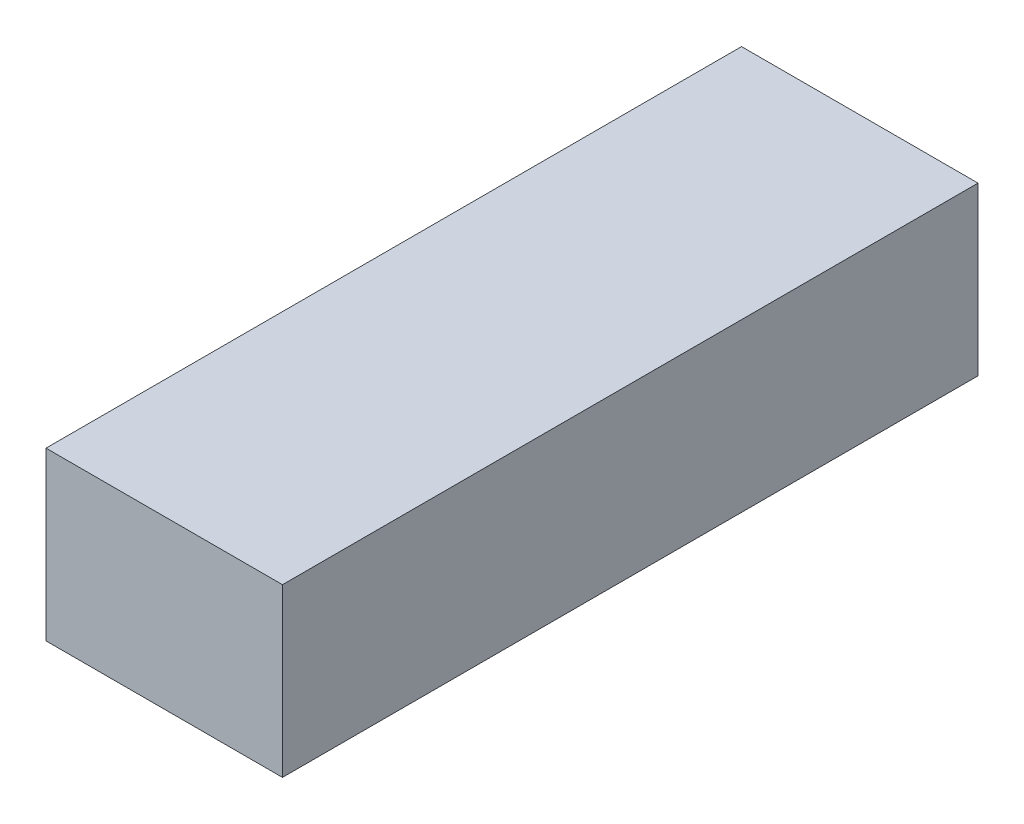
ISO-10303-21;
HEADER;
FILE_DESCRIPTION(('STEP AP214'),'2;1');
FILE_NAME('part.step','',(''),(''),'','','');
FILE_SCHEMA(('AUTOMOTIVE_DESIGN { 1 0 10303 214 1 1 1 1 }'));
ENDSEC;
DATA;
#1=APPLICATION_CONTEXT('core data for automotive mechanical design processes');
#2=APPLICATION_PROTOCOL_DEFINITION('international standard','automotive_design',2000,#1);
#3=PRODUCT_CONTEXT('',#1,'mechanical');
#4=PRODUCT('Part','Part','',(#3));
#5=PRODUCT_RELATED_PRODUCT_CATEGORY('part','',(#4));
#6=PRODUCT_DEFINITION_FORMATION('','',#4);
#7=PRODUCT_DEFINITION_CONTEXT('part definition',#1,'design');
#8=PRODUCT_DEFINITION('design','',#6,#7);
#9=PRODUCT_DEFINITION_SHAPE('','',#8);
#10=(LENGTH_UNIT() NAMED_UNIT(*) SI_UNIT(.MILLI.,.METRE.));
#11=(NAMED_UNIT(*) PLANE_ANGLE_UNIT() SI_UNIT($,.RADIAN.));
#12=(NAMED_UNIT(*) SI_UNIT($,.STERADIAN.) SOLID_ANGLE_UNIT());
#13=UNCERTAINTY_MEASURE_WITH_UNIT(LENGTH_MEASURE(1.E-05),#10,'distance_accuracy_value','');
#14=(GEOMETRIC_REPRESENTATION_CONTEXT(3) GLOBAL_UNCERTAINTY_ASSIGNED_CONTEXT((#13)) GLOBAL_UNIT_ASSIGNED_CONTEXT((#10,
#11,#12)) REPRESENTATION_CONTEXT('',''));
#15=CARTESIAN_POINT('',(0.,0.,0.));
#16=DIRECTION('',(0.,0.,1.));
#17=DIRECTION('',(1.,0.,0.));
#18=AXIS2_PLACEMENT_3D('',#15,#16,#17);
#19=CARTESIAN_POINT('',(0.,2.8,0.));
#20=DIRECTION('',(0.,1.,0.));
#21=DIRECTION('',(0.,0.,1.));
#22=AXIS2_PLACEMENT_3D('',#19,#20,#21);
#23=PLANE('',#22);
#24=CARTESIAN_POINT('',(0.,2.8,-19.1127944876397));
#25=DIRECTION('',(0.,1.,0.));
#26=DIRECTION('',(0.,0.,-1.));
#27=AXIS2_PLACEMENT_3D('',#24,#25,#26);
#28=ELLIPSE('',#27,4.38973331146314,4.125);
#29=CARTESIAN_POINT('',(-3.45,2.8,-16.7064522809072));
#30=VERTEX_POINT('',#29);
#31=CARTESIAN_POINT('',(-0.299801587279874,2.8,-14.7346703882399));
#32=VERTEX_POINT('',#31);
#33=EDGE_CURVE('E253',#30,#32,#28,.T.);
#34=ORIENTED_EDGE('',*,*,#33,.F.);
#35=DIRECTION('',(0.,0.,1.));
#36=VECTOR('',#35,1.);
#37=CARTESIAN_POINT('',(-3.45,2.8,0.));
#38=LINE('',#37,#36);
#39=CARTESIAN_POINT('',(-3.45,2.8,-3.95));
#40=VERTEX_POINT('',#39);
#41=EDGE_CURVE('E299',#30,#40,#38,.T.);
#42=ORIENTED_EDGE('',*,*,#41,.T.);
#43=DIRECTION('',(-1.,0.,0.));
#44=VECTOR('',#43,1.);
#45=CARTESIAN_POINT('',(-3.95,2.8,-3.95));
#46=LINE('',#45,#44);
#47=CARTESIAN_POINT('',(3.45,2.8,-3.95));
#48=VERTEX_POINT('',#47);
#49=EDGE_CURVE('E329',#48,#40,#46,.T.);
#50=ORIENTED_EDGE('',*,*,#49,.F.);
#51=DIRECTION('',(0.,0.,1.));
#52=VECTOR('',#51,1.);
#53=CARTESIAN_POINT('',(3.45,2.8,0.));
#54=LINE('',#53,#52);
#55=CARTESIAN_POINT('',(3.45,2.8,-16.7064522809072));
#56=VERTEX_POINT('',#55);
#57=EDGE_CURVE('E306',#56,#48,#54,.T.);
#58=ORIENTED_EDGE('',*,*,#57,.F.);
#59=CARTESIAN_POINT('',(0.,2.8,-19.1127944876397));
#60=DIRECTION('',(0.,1.,0.));
#61=DIRECTION('',(0.,0.,-1.));
#62=AXIS2_PLACEMENT_3D('',#59,#60,#61);
#63=ELLIPSE('',#62,4.38973331146314,4.125);
#64=CARTESIAN_POINT('',(0.299801587279874,2.8,-14.7346703882399));
#65=VERTEX_POINT('',#64);
#66=EDGE_CURVE('E248',#65,#56,#63,.T.);
#67=ORIENTED_EDGE('',*,*,#66,.F.);
#68=CARTESIAN_POINT('',(0.,2.8,-14.7230611761765));
#69=DIRECTION('',(0.,1.,0.));
#70=DIRECTION('',(0.,0.,-1.));
#71=AXIS2_PLACEMENT_3D('',#68,#69,#70);
#72=ELLIPSE('',#71,0.319253331742773,0.3);
#73=EDGE_CURVE('E263',#65,#32,#72,.T.);
#74=ORIENTED_EDGE('',*,*,#73,.T.);
#75=EDGE_LOOP('',(#34,#42,#50,#58,#67,#74));
#76=FACE_BOUND('',#75,.T.);
#77=ADVANCED_FACE('F35',(#76),#23,.T.);
#78=CARTESIAN_POINT('',(0.,0.,0.));
#79=DIRECTION('',(0.,1.,0.));
#80=DIRECTION('',(0.,0.,1.));
#81=AXIS2_PLACEMENT_3D('',#78,#79,#80);
#82=PLANE('',#81);
#83=DIRECTION('',(1.,0.,0.));
#84=VECTOR('',#83,1.);
#85=CARTESIAN_POINT('',(3.95,0.,4.95));
#86=LINE('',#85,#84);
#87=CARTESIAN_POINT('',(-3.95,0.,4.95));
#88=VERTEX_POINT('',#87);
#89=CARTESIAN_POINT('',(3.95,0.,4.95));
#90=VERTEX_POINT('',#89);
#91=EDGE_CURVE('E390',#88,#90,#86,.T.);
#92=ORIENTED_EDGE('',*,*,#91,.T.);
#93=DIRECTION('',(0.,0.,-1.));
#94=VECTOR('',#93,1.);
#95=CARTESIAN_POINT('',(3.95,0.,-3.95));
#96=LINE('',#95,#94);
#97=CARTESIAN_POINT('',(3.95,0.,-3.95));
#98=VERTEX_POINT('',#97);
#99=EDGE_CURVE('E319',#90,#98,#96,.T.);
#100=ORIENTED_EDGE('',*,*,#99,.T.);
#101=DIRECTION('',(-1.,0.,0.));
#102=VECTOR('',#101,1.);
#103=CARTESIAN_POINT('',(-3.95,0.,-3.95));
#104=LINE('',#103,#102);
#105=CARTESIAN_POINT('',(-3.95,0.,-3.95));
#106=VERTEX_POINT('',#105);
#107=EDGE_CURVE('E338',#98,#106,#104,.T.);
#108=ORIENTED_EDGE('',*,*,#107,.T.);
#109=DIRECTION('',(0.,0.,1.));
#110=VECTOR('',#109,1.);
#111=CARTESIAN_POINT('',(-3.95,0.,-3.95));
#112=LINE('',#111,#110);
#113=EDGE_CURVE('E324',#106,#88,#112,.T.);
#114=ORIENTED_EDGE('',*,*,#113,.T.);
#115=EDGE_LOOP('',(#92,#100,#108,#114));
#116=FACE_BOUND('',#115,.T.);
#117=DIRECTION('',(0.,0.,-1.));
#118=VECTOR('',#117,1.);
#119=CARTESIAN_POINT('',(5.95,0.,-26.65));
#120=LINE('',#119,#118);
#121=CARTESIAN_POINT('',(5.95,0.,8.35));
#122=VERTEX_POINT('',#121);
#123=CARTESIAN_POINT('',(5.95,0.,-26.65));
#124=VERTEX_POINT('',#123);
#125=EDGE_CURVE('E350',#122,#124,#120,.T.);
#126=ORIENTED_EDGE('',*,*,#125,.F.);
#127=DIRECTION('',(1.,0.,0.));
#128=VECTOR('',#127,1.);
#129=CARTESIAN_POINT('',(-5.95,0.,8.35));
#130=LINE('',#129,#128);
#131=CARTESIAN_POINT('',(-5.95,0.,8.35));
#132=VERTEX_POINT('',#131);
#133=EDGE_CURVE('E357',#132,#122,#130,.T.);
#134=ORIENTED_EDGE('',*,*,#133,.F.);
#135=DIRECTION('',(0.,0.,1.));
#136=VECTOR('',#135,1.);
#137=CARTESIAN_POINT('',(-5.95,0.,-26.65));
#138=LINE('',#137,#136);
#139=CARTESIAN_POINT('',(-5.95,0.,-26.65));
#140=VERTEX_POINT('',#139);
#141=EDGE_CURVE('E355',#140,#132,#138,.T.);
#142=ORIENTED_EDGE('',*,*,#141,.F.);
#143=DIRECTION('',(-1.,0.,0.));
#144=VECTOR('',#143,1.);
#145=CARTESIAN_POINT('',(-5.95,0.,-26.65));
#146=LINE('',#145,#144);
#147=EDGE_CURVE('E353',#124,#140,#146,.T.);
#148=ORIENTED_EDGE('',*,*,#147,.F.);
#149=EDGE_LOOP('',(#126,#134,#142,#148));
#150=FACE_BOUND('',#149,.T.);
#151=CARTESIAN_POINT('',(0.,0.,-24.5216444550482));
#152=DIRECTION('',(0.,1.,0.));
#153=DIRECTION('',(0.,0.,-1.));
#154=AXIS2_PLACEMENT_3D('',#151,#152,#153);
#155=ELLIPSE('',#154,0.319253331742775,0.300000000000001);
#156=CARTESIAN_POINT('',(-0.299801587279886,0.,-24.5100352429848));
#157=VERTEX_POINT('',#156);
#158=CARTESIAN_POINT('',(0.299801587279885,0.,-24.5100352429848));
#159=VERTEX_POINT('',#158);
#160=EDGE_CURVE('E387',#157,#159,#155,.T.);
#161=ORIENTED_EDGE('',*,*,#160,.F.);
#162=CARTESIAN_POINT('',(0.,0.,-20.131911143585));
#163=DIRECTION('',(0.,1.,0.));
#164=DIRECTION('',(0.,0.,-1.));
#165=AXIS2_PLACEMENT_3D('',#162,#163,#164);
#166=ELLIPSE('',#165,4.38973331146314,4.125);
#167=CARTESIAN_POINT('',(-4.11409090909091,0.,-20.4509533289213));
#168=VERTEX_POINT('',#167);
#169=EDGE_CURVE('E260',#157,#168,#166,.T.);
#170=ORIENTED_EDGE('',*,*,#169,.T.);
#171=CARTESIAN_POINT('',(-4.125,0.,-20.131911143585));
#172=DIRECTION('',(0.,1.,0.));
#173=DIRECTION('',(0.,0.,-1.));
#174=AXIS2_PLACEMENT_3D('',#171,#172,#173);
#175=ELLIPSE('',#174,0.319253331742775,0.300000000000001);
#176=CARTESIAN_POINT('',(-4.11409090909091,0.,-19.8128689582488));
#177=VERTEX_POINT('',#176);
#178=EDGE_CURVE('E385',#177,#168,#175,.T.);
#179=ORIENTED_EDGE('',*,*,#178,.F.);
#180=CARTESIAN_POINT('',(0.,0.,-20.131911143585));
#181=DIRECTION('',(0.,1.,0.));
#182=DIRECTION('',(0.,0.,-1.));
#183=AXIS2_PLACEMENT_3D('',#180,#181,#182);
#184=ELLIPSE('',#183,4.38973331146314,4.125);
#185=CARTESIAN_POINT('',(-0.299801587279874,0.,-15.7537870441853));
#186=VERTEX_POINT('',#185);
#187=EDGE_CURVE('E255',#177,#186,#184,.T.);
#188=ORIENTED_EDGE('',*,*,#187,.T.);
#189=CARTESIAN_POINT('',(0.,0.,-15.7421778321219));
#190=DIRECTION('',(0.,1.,0.));
#191=DIRECTION('',(0.,0.,-1.));
#192=AXIS2_PLACEMENT_3D('',#189,#190,#191);
#193=ELLIPSE('',#192,0.319253331742773,0.3);
#194=CARTESIAN_POINT('',(0.299801587279874,0.,-15.7537870441853));
#195=VERTEX_POINT('',#194);
#196=EDGE_CURVE('E383',#195,#186,#193,.T.);
#197=ORIENTED_EDGE('',*,*,#196,.F.);
#198=CARTESIAN_POINT('',(0.,0.,-20.131911143585));
#199=DIRECTION('',(0.,1.,0.));
#200=DIRECTION('',(0.,0.,-1.));
#201=AXIS2_PLACEMENT_3D('',#198,#199,#200);
#202=ELLIPSE('',#201,4.38973331146314,4.125);
#203=CARTESIAN_POINT('',(4.11409090909091,0.,-19.8128689582488));
#204=VERTEX_POINT('',#203);
#205=EDGE_CURVE('E250',#195,#204,#202,.T.);
#206=ORIENTED_EDGE('',*,*,#205,.T.);
#207=CARTESIAN_POINT('',(4.125,0.,-20.131911143585));
#208=DIRECTION('',(0.,1.,0.));
#209=DIRECTION('',(0.,0.,-1.));
#210=AXIS2_PLACEMENT_3D('',#207,#208,#209);
#211=ELLIPSE('',#210,0.319253331742775,0.300000000000001);
#212=CARTESIAN_POINT('',(4.11409090909091,0.,-20.4509533289213));
#213=VERTEX_POINT('',#212);
#214=EDGE_CURVE('E381',#213,#204,#211,.T.);
#215=ORIENTED_EDGE('',*,*,#214,.F.);
#216=CARTESIAN_POINT('',(0.,0.,-20.131911143585));
#217=DIRECTION('',(0.,1.,0.));
#218=DIRECTION('',(0.,0.,-1.));
#219=AXIS2_PLACEMENT_3D('',#216,#217,#218);
#220=ELLIPSE('',#219,4.38973331146314,4.125);
#221=EDGE_CURVE('E232',#213,#159,#220,.T.);
#222=ORIENTED_EDGE('',*,*,#221,.T.);
#223=EDGE_LOOP('',(#161,#170,#179,#188,#197,#206,#215,#222));
#224=FACE_BOUND('',#223,.T.);
#225=ADVANCED_FACE('F395',(#116,#150,#224),#82,.F.);
#226=CARTESIAN_POINT('',(0.,2.8,-19.1127944876397));
#227=DIRECTION('',(0.,1.,0.));
#228=DIRECTION('',(0.,0.,-1.));
#229=AXIS2_PLACEMENT_3D('',#226,#227,#228);
#230=ELLIPSE('',#229,4.38973331146314,4.125);
#231=CARTESIAN_POINT('',(-0.299801587279886,2.8,-23.4909185870394));
#232=VERTEX_POINT('',#231);
#233=CARTESIAN_POINT('',(-3.45,2.8,-21.5191366943722));
#234=VERTEX_POINT('',#233);
#235=EDGE_CURVE('E258',#232,#234,#230,.T.);
#236=ORIENTED_EDGE('',*,*,#235,.F.);
#237=CARTESIAN_POINT('',(0.,2.8,-23.5025277991028));
#238=DIRECTION('',(0.,1.,0.));
#239=DIRECTION('',(0.,0.,-1.));
#240=AXIS2_PLACEMENT_3D('',#237,#238,#239);
#241=ELLIPSE('',#240,0.319253331742775,0.300000000000001);
#242=CARTESIAN_POINT('',(0.299801587279885,2.8,-23.4909185870394));
#243=VERTEX_POINT('',#242);
#244=EDGE_CURVE('E266',#232,#243,#241,.T.);
#245=ORIENTED_EDGE('',*,*,#244,.T.);
#246=CARTESIAN_POINT('',(0.,2.8,-19.1127944876397));
#247=DIRECTION('',(0.,1.,0.));
#248=DIRECTION('',(0.,0.,-1.));
#249=AXIS2_PLACEMENT_3D('',#246,#247,#248);
#250=ELLIPSE('',#249,4.38973331146314,4.125);
#251=CARTESIAN_POINT('',(3.45,2.8,-21.5191366943722));
#252=VERTEX_POINT('',#251);
#253=EDGE_CURVE('E244',#252,#243,#250,.T.);
#254=ORIENTED_EDGE('',*,*,#253,.F.);
#255=CARTESIAN_POINT('',(3.45,2.8,-24.65));
#256=VERTEX_POINT('',#255);
#257=EDGE_CURVE('E303',#256,#252,#54,.T.);
#258=ORIENTED_EDGE('',*,*,#257,.F.);
#259=DIRECTION('',(-1.,0.,0.));
#260=VECTOR('',#259,1.);
#261=CARTESIAN_POINT('',(0.,2.8,-24.65));
#262=LINE('',#261,#260);
#263=CARTESIAN_POINT('',(-3.45,2.8,-24.65));
#264=VERTEX_POINT('',#263);
#265=EDGE_CURVE('E298',#256,#264,#262,.T.);
#266=ORIENTED_EDGE('',*,*,#265,.T.);
#267=EDGE_CURVE('E295',#264,#234,#38,.T.);
#268=ORIENTED_EDGE('',*,*,#267,.T.);
#269=EDGE_LOOP('',(#236,#245,#254,#258,#266,#268));
#270=FACE_BOUND('',#269,.T.);
#271=ADVANCED_FACE('F464',(#270),#23,.T.);
#272=CARTESIAN_POINT('',(5.95,2.8,-26.65));
#273=DIRECTION('',(-1.,0.,0.));
#274=DIRECTION('',(0.,0.,1.));
#275=AXIS2_PLACEMENT_3D('',#272,#273,#274);
#276=PLANE('',#275);
#277=ORIENTED_EDGE('',*,*,#125,.T.);
#278=DIRECTION('',(0.,-1.,0.));
#279=VECTOR('',#278,1.);
#280=CARTESIAN_POINT('',(5.95,2.8,-26.65));
#281=LINE('',#280,#279);
#282=CARTESIAN_POINT('',(5.95,8.4,-26.65));
#283=VERTEX_POINT('',#282);
#284=EDGE_CURVE('E368',#283,#124,#281,.T.);
#285=ORIENTED_EDGE('',*,*,#284,.F.);
#286=DIRECTION('',(0.,0.,-1.));
#287=VECTOR('',#286,1.);
#288=CARTESIAN_POINT('',(5.95,8.4,8.35));
#289=LINE('',#288,#287);
#290=CARTESIAN_POINT('',(5.95,8.4,8.35));
#291=VERTEX_POINT('',#290);
#292=EDGE_CURVE('E275',#291,#283,#289,.T.);
#293=ORIENTED_EDGE('',*,*,#292,.F.);
#294=DIRECTION('',(0.,-1.,0.));
#295=VECTOR('',#294,1.);
#296=CARTESIAN_POINT('',(5.95,2.8,8.35));
#297=LINE('',#296,#295);
#298=EDGE_CURVE('E359',#291,#122,#297,.T.);
#299=ORIENTED_EDGE('',*,*,#298,.T.);
#300=EDGE_LOOP('',(#277,#285,#293,#299));
#301=FACE_BOUND('',#300,.T.);
#302=ADVANCED_FACE('F505',(#301),#276,.F.);
#303=CARTESIAN_POINT('',(-5.95,2.8,-26.65));
#304=DIRECTION('',(0.,0.,1.));
#305=DIRECTION('',(1.,0.,0.));
#306=AXIS2_PLACEMENT_3D('',#303,#304,#305);
#307=PLANE('',#306);
#308=ORIENTED_EDGE('',*,*,#147,.T.);
#309=DIRECTION('',(0.,-1.,0.));
#310=VECTOR('',#309,1.);
#311=CARTESIAN_POINT('',(-5.95,2.8,-26.65));
#312=LINE('',#311,#310);
#313=CARTESIAN_POINT('',(-5.95,8.4,-26.65));
#314=VERTEX_POINT('',#313);
#315=EDGE_CURVE('E365',#314,#140,#312,.T.);
#316=ORIENTED_EDGE('',*,*,#315,.F.);
#317=DIRECTION('',(-1.,0.,0.));
#318=VECTOR('',#317,1.);
#319=CARTESIAN_POINT('',(5.95,8.4,-26.65));
#320=LINE('',#319,#318);
#321=EDGE_CURVE('E278',#283,#314,#320,.T.);
#322=ORIENTED_EDGE('',*,*,#321,.F.);
#323=ORIENTED_EDGE('',*,*,#284,.T.);
#324=EDGE_LOOP('',(#308,#316,#322,#323));
#325=FACE_BOUND('',#324,.T.);
#326=ADVANCED_FACE('F509',(#325),#307,.F.);
#327=CARTESIAN_POINT('',(-5.95,2.8,-26.65));
#328=DIRECTION('',(1.,0.,0.));
#329=DIRECTION('',(0.,0.,-1.));
#330=AXIS2_PLACEMENT_3D('',#327,#328,#329);
#331=PLANE('',#330);
#332=ORIENTED_EDGE('',*,*,#141,.T.);
#333=DIRECTION('',(0.,-1.,0.));
#334=VECTOR('',#333,1.);
#335=CARTESIAN_POINT('',(-5.95,2.8,8.35));
#336=LINE('',#335,#334);
#337=CARTESIAN_POINT('',(-5.95,8.4,8.35));
#338=VERTEX_POINT('',#337);
#339=EDGE_CURVE('E362',#338,#132,#336,.T.);
#340=ORIENTED_EDGE('',*,*,#339,.F.);
#341=DIRECTION('',(0.,0.,1.));
#342=VECTOR('',#341,1.);
#343=CARTESIAN_POINT('',(-5.95,8.4,-26.65));
#344=LINE('',#343,#342);
#345=EDGE_CURVE('E269',#314,#338,#344,.T.);
#346=ORIENTED_EDGE('',*,*,#345,.F.);
#347=ORIENTED_EDGE('',*,*,#315,.T.);
#348=EDGE_LOOP('',(#332,#340,#346,#347));
#349=FACE_BOUND('',#348,.T.);
#350=ADVANCED_FACE('F514',(#349),#331,.F.);
#351=CARTESIAN_POINT('',(-5.95,2.8,8.35));
#352=DIRECTION('',(0.,0.,-1.));
#353=DIRECTION('',(-1.,0.,0.));
#354=AXIS2_PLACEMENT_3D('',#351,#352,#353);
#355=PLANE('',#354);
#356=ORIENTED_EDGE('',*,*,#133,.T.);
#357=ORIENTED_EDGE('',*,*,#298,.F.);
#358=DIRECTION('',(1.,0.,0.));
#359=VECTOR('',#358,1.);
#360=CARTESIAN_POINT('',(-5.95,8.4,8.35));
#361=LINE('',#360,#359);
#362=EDGE_CURVE('E272',#338,#291,#361,.T.);
#363=ORIENTED_EDGE('',*,*,#362,.F.);
#364=ORIENTED_EDGE('',*,*,#339,.T.);
#365=EDGE_LOOP('',(#356,#357,#363,#364));
#366=FACE_BOUND('',#365,.T.);
#367=ADVANCED_FACE('F520',(#366),#355,.F.);
#368=CARTESIAN_POINT('',(3.95,2.8,-3.95));
#369=DIRECTION('',(-1.,0.,0.));
#370=DIRECTION('',(0.,0.,1.));
#371=AXIS2_PLACEMENT_3D('',#368,#369,#370);
#372=PLANE('',#371);
#373=ORIENTED_EDGE('',*,*,#99,.F.);
#374=DIRECTION('',(0.,0.707106781186549,-0.707106781186546));
#375=VECTOR('',#374,1.);
#376=CARTESIAN_POINT('',(3.95,0.,4.95));
#377=LINE('',#376,#375);
#378=CARTESIAN_POINT('',(3.95,1.00000000000001,3.95));
#379=VERTEX_POINT('',#378);
#380=EDGE_CURVE('E43',#90,#379,#377,.T.);
#381=ORIENTED_EDGE('',*,*,#380,.T.);
#382=DIRECTION('',(0.,-1.,0.));
#383=VECTOR('',#382,1.);
#384=CARTESIAN_POINT('',(3.95,2.8,3.95));
#385=LINE('',#384,#383);
#386=CARTESIAN_POINT('',(3.95,2.8,3.95));
#387=VERTEX_POINT('',#386);
#388=EDGE_CURVE('E335',#387,#379,#385,.T.);
#389=ORIENTED_EDGE('',*,*,#388,.F.);
#390=DIRECTION('',(0.,0.,-1.));
#391=VECTOR('',#390,1.);
#392=CARTESIAN_POINT('',(3.95,2.8,-3.95));
#393=LINE('',#392,#391);
#394=CARTESIAN_POINT('',(3.95,2.8,-3.95));
#395=VERTEX_POINT('',#394);
#396=EDGE_CURVE('E320',#387,#395,#393,.T.);
#397=ORIENTED_EDGE('',*,*,#396,.T.);
#398=DIRECTION('',(0.,-1.,0.));
#399=VECTOR('',#398,1.);
#400=CARTESIAN_POINT('',(3.95,2.8,-3.95));
#401=LINE('',#400,#399);
#402=EDGE_CURVE('E347',#395,#98,#401,.T.);
#403=ORIENTED_EDGE('',*,*,#402,.T.);
#404=EDGE_LOOP('',(#373,#381,#389,#397,#403));
#405=FACE_BOUND('',#404,.T.);
#406=ADVANCED_FACE('F405',(#405),#372,.T.);
#407=CARTESIAN_POINT('',(-3.95,2.8,-3.95));
#408=DIRECTION('',(0.,0.,1.));
#409=DIRECTION('',(1.,0.,0.));
#410=AXIS2_PLACEMENT_3D('',#407,#408,#409);
#411=PLANE('',#410);
#412=ORIENTED_EDGE('',*,*,#107,.F.);
#413=ORIENTED_EDGE('',*,*,#402,.F.);
#414=EDGE_CURVE('E325',#395,#48,#46,.T.);
#415=ORIENTED_EDGE('',*,*,#414,.T.);
#416=ORIENTED_EDGE('',*,*,#49,.T.);
#417=CARTESIAN_POINT('',(-3.95,2.8,-3.95));
#418=VERTEX_POINT('',#417);
#419=EDGE_CURVE('E323',#40,#418,#46,.T.);
#420=ORIENTED_EDGE('',*,*,#419,.T.);
#421=DIRECTION('',(0.,-1.,0.));
#422=VECTOR('',#421,1.);
#423=CARTESIAN_POINT('',(-3.95,2.8,-3.95));
#424=LINE('',#423,#422);
#425=EDGE_CURVE('E345',#418,#106,#424,.T.);
#426=ORIENTED_EDGE('',*,*,#425,.T.);
#427=EDGE_LOOP('',(#412,#413,#415,#416,#420,#426));
#428=FACE_BOUND('',#427,.T.);
#429=ADVANCED_FACE('F408',(#428),#411,.T.);
#430=CARTESIAN_POINT('',(-3.95,2.8,-3.95));
#431=DIRECTION('',(1.,0.,0.));
#432=DIRECTION('',(0.,0.,-1.));
#433=AXIS2_PLACEMENT_3D('',#430,#431,#432);
#434=PLANE('',#433);
#435=ORIENTED_EDGE('',*,*,#113,.F.);
#436=ORIENTED_EDGE('',*,*,#425,.F.);
#437=DIRECTION('',(0.,0.,1.));
#438=VECTOR('',#437,1.);
#439=CARTESIAN_POINT('',(-3.95,2.8,-3.95));
#440=LINE('',#439,#438);
#441=CARTESIAN_POINT('',(-3.95,2.8,3.95));
#442=VERTEX_POINT('',#441);
#443=EDGE_CURVE('E328',#418,#442,#440,.T.);
#444=ORIENTED_EDGE('',*,*,#443,.T.);
#445=DIRECTION('',(0.,-1.,0.));
#446=VECTOR('',#445,1.);
#447=CARTESIAN_POINT('',(-3.95,2.8,3.95));
#448=LINE('',#447,#446);
#449=CARTESIAN_POINT('',(-3.95,1.00000000000001,3.95));
#450=VERTEX_POINT('',#449);
#451=EDGE_CURVE('E343',#442,#450,#448,.T.);
#452=ORIENTED_EDGE('',*,*,#451,.T.);
#453=DIRECTION('',(0.,-0.707106781186549,0.707106781186546));
#454=VECTOR('',#453,1.);
#455=CARTESIAN_POINT('',(-3.95,0.,4.95));
#456=LINE('',#455,#454);
#457=EDGE_CURVE('E11',#450,#88,#456,.T.);
#458=ORIENTED_EDGE('',*,*,#457,.T.);
#459=EDGE_LOOP('',(#435,#436,#444,#452,#458));
#460=FACE_BOUND('',#459,.T.);
#461=ADVANCED_FACE('F401',(#460),#434,.T.);
#462=CARTESIAN_POINT('',(-3.95,2.8,3.95));
#463=DIRECTION('',(0.,0.,-1.));
#464=DIRECTION('',(-1.,0.,0.));
#465=AXIS2_PLACEMENT_3D('',#462,#463,#464);
#466=PLANE('',#465);
#467=ORIENTED_EDGE('',*,*,#388,.T.);
#468=DIRECTION('',(-1.,0.,0.));
#469=VECTOR('',#468,1.);
#470=CARTESIAN_POINT('',(-3.95,1.00000000000001,3.95));
#471=LINE('',#470,#469);
#472=EDGE_CURVE('E56',#379,#450,#471,.T.);
#473=ORIENTED_EDGE('',*,*,#472,.T.);
#474=ORIENTED_EDGE('',*,*,#451,.F.);
#475=DIRECTION('',(1.,0.,0.));
#476=VECTOR('',#475,1.);
#477=CARTESIAN_POINT('',(-3.95,2.8,3.95));
#478=LINE('',#477,#476);
#479=EDGE_CURVE('E332',#442,#387,#478,.T.);
#480=ORIENTED_EDGE('',*,*,#479,.T.);
#481=EDGE_LOOP('',(#467,#473,#474,#480));
#482=FACE_BOUND('',#481,.T.);
#483=ADVANCED_FACE('F403',(#482),#466,.T.);
#484=CARTESIAN_POINT('',(-3.45,6.8,0.));
#485=DIRECTION('',(1.,0.,0.));
#486=DIRECTION('',(0.,0.,-1.));
#487=AXIS2_PLACEMENT_3D('',#484,#485,#486);
#488=PLANE('',#487);
#489=DIRECTION('',(0.,-0.939692620785908,-0.34202014332567));
#490=VECTOR('',#489,1.);
#491=CARTESIAN_POINT('',(-3.45,5.53826623144411,-20.5224892926302));
#492=LINE('',#491,#490);
#493=CARTESIAN_POINT('',(-3.45,5.53826623144411,-20.5224892926302));
#494=VERTEX_POINT('',#493);
#495=EDGE_CURVE('E379',#234,#494,#492,.F.);
#496=ORIENTED_EDGE('',*,*,#495,.F.);
#497=ORIENTED_EDGE('',*,*,#267,.F.);
#498=DIRECTION('',(0.,-1.,0.));
#499=VECTOR('',#498,1.);
#500=CARTESIAN_POINT('',(-3.45,6.8,-24.65));
#501=LINE('',#500,#499);
#502=CARTESIAN_POINT('',(-3.45,6.8,-24.65));
#503=VERTEX_POINT('',#502);
#504=EDGE_CURVE('E316',#503,#264,#501,.T.);
#505=ORIENTED_EDGE('',*,*,#504,.F.);
#506=DIRECTION('',(0.,0.,1.));
#507=VECTOR('',#506,1.);
#508=CARTESIAN_POINT('',(-3.45,6.8,0.));
#509=LINE('',#508,#507);
#510=CARTESIAN_POINT('',(-3.45,6.8,3.45));
#511=VERTEX_POINT('',#510);
#512=EDGE_CURVE('E282',#503,#511,#509,.T.);
#513=ORIENTED_EDGE('',*,*,#512,.T.);
#514=DIRECTION('',(0.,-1.,0.));
#515=VECTOR('',#514,1.);
#516=CARTESIAN_POINT('',(-3.45,6.8,3.45));
#517=LINE('',#516,#515);
#518=CARTESIAN_POINT('',(-3.45,2.8,3.45));
#519=VERTEX_POINT('',#518);
#520=EDGE_CURVE('E294',#511,#519,#517,.T.);
#521=ORIENTED_EDGE('',*,*,#520,.T.);
#522=EDGE_CURVE('E281',#40,#519,#38,.T.);
#523=ORIENTED_EDGE('',*,*,#522,.F.);
#524=ORIENTED_EDGE('',*,*,#41,.F.);
#525=DIRECTION('',(0.,-0.939692620785908,-0.34202014332567));
#526=VECTOR('',#525,1.);
#527=CARTESIAN_POINT('',(-3.45,3.9914992762907,-16.2727820101876));
#528=LINE('',#527,#526);
#529=CARTESIAN_POINT('',(-3.45,3.9914992762907,-16.2727820101876));
#530=VERTEX_POINT('',#529);
#531=EDGE_CURVE('E377',#530,#30,#528,.T.);
#532=ORIENTED_EDGE('',*,*,#531,.F.);
#533=DIRECTION('',(0.,0.34202014332567,-0.939692620785908));
#534=VECTOR('',#533,1.);
#535=CARTESIAN_POINT('',(-3.45,-0.90993987394055,-2.80618862209648));
#536=LINE('',#535,#534);
#537=EDGE_CURVE('E241',#530,#494,#536,.T.);
#538=ORIENTED_EDGE('',*,*,#537,.T.);
#539=EDGE_LOOP('',(#496,#497,#505,#513,#521,#523,#524,#532,#538));
#540=FACE_BOUND('',#539,.T.);
#541=ADVANCED_FACE('F418',(#540),#488,.T.);
#542=CARTESIAN_POINT('',(0.,6.8,-24.65));
#543=DIRECTION('',(0.,0.,1.));
#544=DIRECTION('',(1.,0.,0.));
#545=AXIS2_PLACEMENT_3D('',#542,#543,#544);
#546=PLANE('',#545);
#547=ORIENTED_EDGE('',*,*,#265,.F.);
#548=DIRECTION('',(0.,-1.,0.));
#549=VECTOR('',#548,1.);
#550=CARTESIAN_POINT('',(3.45,6.8,-24.65));
#551=LINE('',#550,#549);
#552=CARTESIAN_POINT('',(3.45,6.8,-24.65));
#553=VERTEX_POINT('',#552);
#554=EDGE_CURVE('E314',#553,#256,#551,.T.);
#555=ORIENTED_EDGE('',*,*,#554,.F.);
#556=DIRECTION('',(-1.,0.,0.));
#557=VECTOR('',#556,1.);
#558=CARTESIAN_POINT('',(0.,6.8,-24.65));
#559=LINE('',#558,#557);
#560=EDGE_CURVE('E285',#553,#503,#559,.T.);
#561=ORIENTED_EDGE('',*,*,#560,.T.);
#562=ORIENTED_EDGE('',*,*,#504,.T.);
#563=EDGE_LOOP('',(#547,#555,#561,#562));
#564=FACE_BOUND('',#563,.T.);
#565=ADVANCED_FACE('F480',(#564),#546,.T.);
#566=CARTESIAN_POINT('',(3.45,6.8,0.));
#567=DIRECTION('',(1.,0.,0.));
#568=DIRECTION('',(0.,0.,-1.));
#569=AXIS2_PLACEMENT_3D('',#566,#567,#568);
#570=PLANE('',#569);
#571=DIRECTION('',(0.,0.34202014332567,-0.939692620785908));
#572=VECTOR('',#571,1.);
#573=CARTESIAN_POINT('',(3.45,-0.90993987394055,-2.80618862209648));
#574=LINE('',#573,#572);
#575=CARTESIAN_POINT('',(3.45,3.9914992762907,-16.2727820101876));
#576=VERTEX_POINT('',#575);
#577=CARTESIAN_POINT('',(3.45,5.53826623144411,-20.5224892926302));
#578=VERTEX_POINT('',#577);
#579=EDGE_CURVE('E215',#576,#578,#574,.T.);
#580=ORIENTED_EDGE('',*,*,#579,.F.);
#581=DIRECTION('',(0.,-0.939692620785908,-0.34202014332567));
#582=VECTOR('',#581,1.);
#583=CARTESIAN_POINT('',(3.45,3.9914992762907,-16.2727820101876));
#584=LINE('',#583,#582);
#585=EDGE_CURVE('E374',#576,#56,#584,.T.);
#586=ORIENTED_EDGE('',*,*,#585,.T.);
#587=ORIENTED_EDGE('',*,*,#57,.T.);
#588=CARTESIAN_POINT('',(3.45,2.8,3.45));
#589=VERTEX_POINT('',#588);
#590=EDGE_CURVE('E302',#48,#589,#54,.T.);
#591=ORIENTED_EDGE('',*,*,#590,.T.);
#592=DIRECTION('',(0.,-1.,0.));
#593=VECTOR('',#592,1.);
#594=CARTESIAN_POINT('',(3.45,6.8,3.45));
#595=LINE('',#594,#593);
#596=CARTESIAN_POINT('',(3.45,6.8,3.45));
#597=VERTEX_POINT('',#596);
#598=EDGE_CURVE('E311',#597,#589,#595,.T.);
#599=ORIENTED_EDGE('',*,*,#598,.F.);
#600=DIRECTION('',(0.,0.,1.));
#601=VECTOR('',#600,1.);
#602=CARTESIAN_POINT('',(3.45,6.8,0.));
#603=LINE('',#602,#601);
#604=EDGE_CURVE('E289',#553,#597,#603,.T.);
#605=ORIENTED_EDGE('',*,*,#604,.F.);
#606=ORIENTED_EDGE('',*,*,#554,.T.);
#607=ORIENTED_EDGE('',*,*,#257,.T.);
#608=DIRECTION('',(0.,-0.939692620785908,-0.34202014332567));
#609=VECTOR('',#608,1.);
#610=CARTESIAN_POINT('',(3.45,5.53826623144411,-20.5224892926302));
#611=LINE('',#610,#609);
#612=EDGE_CURVE('E372',#252,#578,#611,.F.);
#613=ORIENTED_EDGE('',*,*,#612,.T.);
#614=EDGE_LOOP('',(#580,#586,#587,#591,#599,#605,#606,#607,#613));
#615=FACE_BOUND('',#614,.T.);
#616=ADVANCED_FACE('F458',(#615),#570,.F.);
#617=CARTESIAN_POINT('',(0.,6.8,3.45));
#618=DIRECTION('',(0.,0.,-1.));
#619=DIRECTION('',(-1.,0.,0.));
#620=AXIS2_PLACEMENT_3D('',#617,#618,#619);
#621=PLANE('',#620);
#622=DIRECTION('',(1.,0.,0.));
#623=VECTOR('',#622,1.);
#624=CARTESIAN_POINT('',(0.,2.8,3.45));
#625=LINE('',#624,#623);
#626=EDGE_CURVE('E286',#519,#589,#625,.T.);
#627=ORIENTED_EDGE('',*,*,#626,.F.);
#628=ORIENTED_EDGE('',*,*,#520,.F.);
#629=DIRECTION('',(1.,0.,0.));
#630=VECTOR('',#629,1.);
#631=CARTESIAN_POINT('',(0.,6.8,3.45));
#632=LINE('',#631,#630);
#633=EDGE_CURVE('E291',#511,#597,#632,.T.);
#634=ORIENTED_EDGE('',*,*,#633,.T.);
#635=ORIENTED_EDGE('',*,*,#598,.T.);
#636=EDGE_LOOP('',(#627,#628,#634,#635));
#637=FACE_BOUND('',#636,.T.);
#638=ADVANCED_FACE('F486',(#637),#621,.T.);
#639=CARTESIAN_POINT('',(0.,2.8,0.));
#640=DIRECTION('',(0.,1.,0.));
#641=DIRECTION('',(0.,0.,1.));
#642=AXIS2_PLACEMENT_3D('',#639,#640,#641);
#643=PLANE('',#642);
#644=ORIENTED_EDGE('',*,*,#414,.F.);
#645=ORIENTED_EDGE('',*,*,#396,.F.);
#646=ORIENTED_EDGE('',*,*,#479,.F.);
#647=ORIENTED_EDGE('',*,*,#443,.F.);
#648=ORIENTED_EDGE('',*,*,#419,.F.);
#649=ORIENTED_EDGE('',*,*,#522,.T.);
#650=ORIENTED_EDGE('',*,*,#626,.T.);
#651=ORIENTED_EDGE('',*,*,#590,.F.);
#652=EDGE_LOOP('',(#644,#645,#646,#647,#648,#649,#650,#651));
#653=FACE_BOUND('',#652,.T.);
#654=ADVANCED_FACE('F414',(#653),#643,.F.);
#655=CARTESIAN_POINT('',(0.,8.4,0.));
#656=DIRECTION('',(0.,1.,0.));
#657=DIRECTION('',(0.,0.,1.));
#658=AXIS2_PLACEMENT_3D('',#655,#656,#657);
#659=PLANE('',#658);
#660=ORIENTED_EDGE('',*,*,#345,.T.);
#661=ORIENTED_EDGE('',*,*,#362,.T.);
#662=ORIENTED_EDGE('',*,*,#292,.T.);
#663=ORIENTED_EDGE('',*,*,#321,.T.);
#664=EDGE_LOOP('',(#660,#661,#662,#663));
#665=FACE_BOUND('',#664,.T.);
#666=ADVANCED_FACE('F494',(#665),#659,.T.);
#667=CARTESIAN_POINT('',(0.,6.8,0.));
#668=DIRECTION('',(0.,1.,0.));
#669=DIRECTION('',(0.,0.,1.));
#670=AXIS2_PLACEMENT_3D('',#667,#668,#669);
#671=PLANE('',#670);
#672=ORIENTED_EDGE('',*,*,#512,.F.);
#673=ORIENTED_EDGE('',*,*,#560,.F.);
#674=ORIENTED_EDGE('',*,*,#604,.T.);
#675=ORIENTED_EDGE('',*,*,#633,.F.);
#676=EDGE_LOOP('',(#672,#673,#674,#675));
#677=FACE_BOUND('',#676,.T.);
#678=ADVANCED_FACE('F483',(#677),#671,.F.);
#679=CARTESIAN_POINT('',(0.,6.17571584508579,-22.2738677121508));
#680=DIRECTION('',(0.,-0.939692620785908,-0.34202014332567));
#681=DIRECTION('',(0.,0.34202014332567,-0.939692620785908));
#682=AXIS2_PLACEMENT_3D('',#679,#680,#681);
#683=CYLINDRICAL_SURFACE('',#682,0.300000000000001);
#684=DIRECTION('',(0.,-0.939692620785908,-0.34202014332567));
#685=VECTOR('',#684,1.);
#686=CARTESIAN_POINT('',(-0.299801587279886,6.17198471624951,-22.263616519924));
#687=LINE('',#686,#685);
#688=EDGE_CURVE('E245',#232,#157,#687,.T.);
#689=ORIENTED_EDGE('',*,*,#688,.T.);
#690=ORIENTED_EDGE('',*,*,#160,.T.);
#691=DIRECTION('',(0.,-0.939692620785908,-0.34202014332567));
#692=VECTOR('',#691,1.);
#693=CARTESIAN_POINT('',(0.299801587279885,6.17198471624951,-22.263616519924));
#694=LINE('',#693,#692);
#695=EDGE_CURVE('E233',#243,#159,#694,.T.);
#696=ORIENTED_EDGE('',*,*,#695,.F.);
#697=ORIENTED_EDGE('',*,*,#244,.F.);
#698=EDGE_LOOP('',(#689,#690,#696,#697));
#699=FACE_BOUND('',#698,.T.);
#700=ADVANCED_FACE('F467',(#699),#683,.T.);
#701=CARTESIAN_POINT('',(-4.125,4.76488275386741,-18.3976356514089));
#702=DIRECTION('',(0.,-0.939692620785908,-0.34202014332567));
#703=DIRECTION('',(0.,0.34202014332567,-0.939692620785908));
#704=AXIS2_PLACEMENT_3D('',#701,#702,#703);
#705=CYLINDRICAL_SURFACE('',#704,0.300000000000001);
#706=ORIENTED_EDGE('',*,*,#178,.T.);
#707=DIRECTION('',(0.,-0.939692620785908,-0.34202014332567));
#708=VECTOR('',#707,1.);
#709=CARTESIAN_POINT('',(-4.11409090909091,4.86742093571814,-18.6793569906757));
#710=LINE('',#709,#708);
#711=CARTESIAN_POINT('',(-4.11409090909091,4.86742093571814,-18.6793569906757));
#712=VERTEX_POINT('',#711);
#713=EDGE_CURVE('E441',#712,#168,#710,.T.);
#714=ORIENTED_EDGE('',*,*,#713,.F.);
#715=CARTESIAN_POINT('',(-4.125,4.76488275386741,-18.3976356514089));
#716=DIRECTION('',(0.,-0.939692620785908,-0.34202014332567));
#717=DIRECTION('',(0.,0.34202014332567,-0.939692620785908));
#718=AXIS2_PLACEMENT_3D('',#715,#716,#717);
#719=CIRCLE('',#718,0.300000000000001);
#720=CARTESIAN_POINT('',(-4.11409090909091,4.66234457201667,-18.1159143121421));
#721=VERTEX_POINT('',#720);
#722=EDGE_CURVE('E448',#712,#721,#719,.T.);
#723=ORIENTED_EDGE('',*,*,#722,.T.);
#724=DIRECTION('',(0.,-0.939692620785908,-0.34202014332567));
#725=VECTOR('',#724,1.);
#726=CARTESIAN_POINT('',(-4.11409090909091,4.66234457201667,-18.1159143121421));
#727=LINE('',#726,#725);
#728=EDGE_CURVE('E438',#721,#177,#727,.T.);
#729=ORIENTED_EDGE('',*,*,#728,.T.);
#730=EDGE_LOOP('',(#706,#714,#723,#729));
#731=FACE_BOUND('',#730,.T.);
#732=ADVANCED_FACE('F474',(#731),#705,.T.);
#733=CARTESIAN_POINT('',(0.,3.35404966264902,-14.5214035906671));
#734=DIRECTION('',(0.,-0.939692620785908,-0.34202014332567));
#735=DIRECTION('',(0.,0.34202014332567,-0.939692620785908));
#736=AXIS2_PLACEMENT_3D('',#733,#734,#735);
#737=CYLINDRICAL_SURFACE('',#736,0.3);
#738=DIRECTION('',(0.,-0.939692620785908,-0.34202014332567));
#739=VECTOR('',#738,1.);
#740=CARTESIAN_POINT('',(0.299801587279874,3.3577807914853,-14.5316547828938));
#741=LINE('',#740,#739);
#742=EDGE_CURVE('E235',#65,#195,#741,.T.);
#743=ORIENTED_EDGE('',*,*,#742,.T.);
#744=ORIENTED_EDGE('',*,*,#196,.T.);
#745=DIRECTION('',(0.,-0.939692620785908,-0.34202014332567));
#746=VECTOR('',#745,1.);
#747=CARTESIAN_POINT('',(-0.299801587279874,3.3577807914853,-14.5316547828938));
#748=LINE('',#747,#746);
#749=EDGE_CURVE('E431',#32,#186,#748,.T.);
#750=ORIENTED_EDGE('',*,*,#749,.F.);
#751=ORIENTED_EDGE('',*,*,#73,.F.);
#752=EDGE_LOOP('',(#743,#744,#750,#751));
#753=FACE_BOUND('',#752,.T.);
#754=ADVANCED_FACE('F435',(#753),#737,.T.);
#755=CARTESIAN_POINT('',(4.125,4.76488275386741,-18.3976356514089));
#756=DIRECTION('',(0.,-0.939692620785908,-0.34202014332567));
#757=DIRECTION('',(0.,0.34202014332567,-0.939692620785908));
#758=AXIS2_PLACEMENT_3D('',#755,#756,#757);
#759=CYLINDRICAL_SURFACE('',#758,0.300000000000001);
#760=ORIENTED_EDGE('',*,*,#214,.T.);
#761=DIRECTION('',(0.,-0.939692620785908,-0.34202014332567));
#762=VECTOR('',#761,1.);
#763=CARTESIAN_POINT('',(4.11409090909091,4.66234457201667,-18.1159143121421));
#764=LINE('',#763,#762);
#765=CARTESIAN_POINT('',(4.11409090909091,4.66234457201667,-18.1159143121421));
#766=VERTEX_POINT('',#765);
#767=EDGE_CURVE('E228',#766,#204,#764,.T.);
#768=ORIENTED_EDGE('',*,*,#767,.F.);
#769=CARTESIAN_POINT('',(4.125,4.76488275386741,-18.3976356514089));
#770=DIRECTION('',(0.,-0.939692620785908,-0.34202014332567));
#771=DIRECTION('',(0.,0.34202014332567,-0.939692620785908));
#772=AXIS2_PLACEMENT_3D('',#769,#770,#771);
#773=CIRCLE('',#772,0.300000000000001);
#774=CARTESIAN_POINT('',(4.11409090909091,4.86742093571814,-18.6793569906757));
#775=VERTEX_POINT('',#774);
#776=EDGE_CURVE('E212',#766,#775,#773,.T.);
#777=ORIENTED_EDGE('',*,*,#776,.T.);
#778=DIRECTION('',(0.,-0.939692620785908,-0.34202014332567));
#779=VECTOR('',#778,1.);
#780=CARTESIAN_POINT('',(4.11409090909091,4.86742093571814,-18.6793569906757));
#781=LINE('',#780,#779);
#782=EDGE_CURVE('E225',#775,#213,#781,.T.);
#783=ORIENTED_EDGE('',*,*,#782,.T.);
#784=EDGE_LOOP('',(#760,#768,#777,#783));
#785=FACE_BOUND('',#784,.T.);
#786=ADVANCED_FACE('F224',(#785),#759,.T.);
#787=CARTESIAN_POINT('',(0.,4.76488275386741,-18.3976356514089));
#788=DIRECTION('',(0.,-0.939692620785908,-0.34202014332567));
#789=DIRECTION('',(0.,0.34202014332567,-0.939692620785908));
#790=AXIS2_PLACEMENT_3D('',#787,#788,#789);
#791=CYLINDRICAL_SURFACE('',#790,4.125);
#792=ORIENTED_EDGE('',*,*,#688,.F.);
#793=ORIENTED_EDGE('',*,*,#235,.T.);
#794=ORIENTED_EDGE('',*,*,#495,.T.);
#795=CARTESIAN_POINT('',(0.,4.76488275386741,-18.3976356514089));
#796=DIRECTION('',(0.,-0.939692620785908,-0.34202014332567));
#797=DIRECTION('',(0.,0.34202014332567,-0.939692620785908));
#798=AXIS2_PLACEMENT_3D('',#795,#796,#797);
#799=CIRCLE('',#798,4.125);
#800=EDGE_CURVE('E237',#712,#494,#799,.T.);
#801=ORIENTED_EDGE('',*,*,#800,.F.);
#802=ORIENTED_EDGE('',*,*,#713,.T.);
#803=ORIENTED_EDGE('',*,*,#169,.F.);
#804=EDGE_LOOP('',(#792,#793,#794,#801,#802,#803));
#805=FACE_BOUND('',#804,.T.);
#806=ADVANCED_FACE('F470',(#805),#791,.F.);
#807=ORIENTED_EDGE('',*,*,#728,.F.);
#808=EDGE_CURVE('E220',#530,#721,#799,.T.);
#809=ORIENTED_EDGE('',*,*,#808,.F.);
#810=ORIENTED_EDGE('',*,*,#531,.T.);
#811=ORIENTED_EDGE('',*,*,#33,.T.);
#812=ORIENTED_EDGE('',*,*,#749,.T.);
#813=ORIENTED_EDGE('',*,*,#187,.F.);
#814=EDGE_LOOP('',(#807,#809,#810,#811,#812,#813));
#815=FACE_BOUND('',#814,.T.);
#816=ADVANCED_FACE('F430',(#815),#791,.F.);
#817=ORIENTED_EDGE('',*,*,#742,.F.);
#818=ORIENTED_EDGE('',*,*,#66,.T.);
#819=ORIENTED_EDGE('',*,*,#585,.F.);
#820=EDGE_CURVE('E221',#766,#576,#799,.T.);
#821=ORIENTED_EDGE('',*,*,#820,.F.);
#822=ORIENTED_EDGE('',*,*,#767,.T.);
#823=ORIENTED_EDGE('',*,*,#205,.F.);
#824=EDGE_LOOP('',(#817,#818,#819,#821,#822,#823));
#825=FACE_BOUND('',#824,.T.);
#826=ADVANCED_FACE('F456',(#825),#791,.F.);
#827=ORIENTED_EDGE('',*,*,#782,.F.);
#828=EDGE_CURVE('E209',#578,#775,#799,.T.);
#829=ORIENTED_EDGE('',*,*,#828,.F.);
#830=ORIENTED_EDGE('',*,*,#612,.F.);
#831=ORIENTED_EDGE('',*,*,#253,.T.);
#832=ORIENTED_EDGE('',*,*,#695,.T.);
#833=ORIENTED_EDGE('',*,*,#221,.F.);
#834=EDGE_LOOP('',(#827,#829,#830,#831,#832,#833));
#835=FACE_BOUND('',#834,.T.);
#836=ADVANCED_FACE('F230',(#835),#791,.F.);
#837=CARTESIAN_POINT('',(0.,-1.70538876733603,-0.620710749162246));
#838=DIRECTION('',(0.,-0.939692620785908,-0.34202014332567));
#839=DIRECTION('',(0.,0.34202014332567,-0.939692620785908));
#840=AXIS2_PLACEMENT_3D('',#837,#838,#839);
#841=PLANE('',#840);
#842=ORIENTED_EDGE('',*,*,#579,.T.);
#843=ORIENTED_EDGE('',*,*,#828,.T.);
#844=ORIENTED_EDGE('',*,*,#776,.F.);
#845=ORIENTED_EDGE('',*,*,#820,.T.);
#846=EDGE_LOOP('',(#842,#843,#844,#845));
#847=FACE_BOUND('',#846,.T.);
#848=ADVANCED_FACE('F211',(#847),#841,.T.);
#849=ORIENTED_EDGE('',*,*,#808,.T.);
#850=ORIENTED_EDGE('',*,*,#722,.F.);
#851=ORIENTED_EDGE('',*,*,#800,.T.);
#852=ORIENTED_EDGE('',*,*,#537,.F.);
#853=EDGE_LOOP('',(#849,#850,#851,#852));
#854=FACE_BOUND('',#853,.T.);
#855=ADVANCED_FACE('F475',(#854),#841,.T.);
#856=CARTESIAN_POINT('',(0.,0.,4.95));
#857=DIRECTION('',(0.,-0.707106781186546,-0.707106781186549));
#858=DIRECTION('',(-1.,0.,0.));
#859=AXIS2_PLACEMENT_3D('',#856,#857,#858);
#860=PLANE('',#859);
#861=ORIENTED_EDGE('',*,*,#457,.F.);
#862=ORIENTED_EDGE('',*,*,#472,.F.);
#863=ORIENTED_EDGE('',*,*,#380,.F.);
#864=ORIENTED_EDGE('',*,*,#91,.F.);
#865=EDGE_LOOP('',(#861,#862,#863,#864));
#866=FACE_BOUND('',#865,.T.);
#867=ADVANCED_FACE('F37',(#866),#860,.T.);
#868=CLOSED_SHELL('',(#77,#225,#271,#302,#326,#350,#367,#406,#429,#461,#483,#541,#565,#616,#638,
#654,#666,#678,#700,#732,#754,#786,#806,#816,#826,#836,#848,#855,#867));
#869=MANIFOLD_SOLID_BREP('B2',#868);
#870=ADVANCED_BREP_SHAPE_REPRESENTATION('',(#18,#869),#14);
#871=SHAPE_DEFINITION_REPRESENTATION(#9,#870);
ENDSEC;
END-ISO-10303-21;
